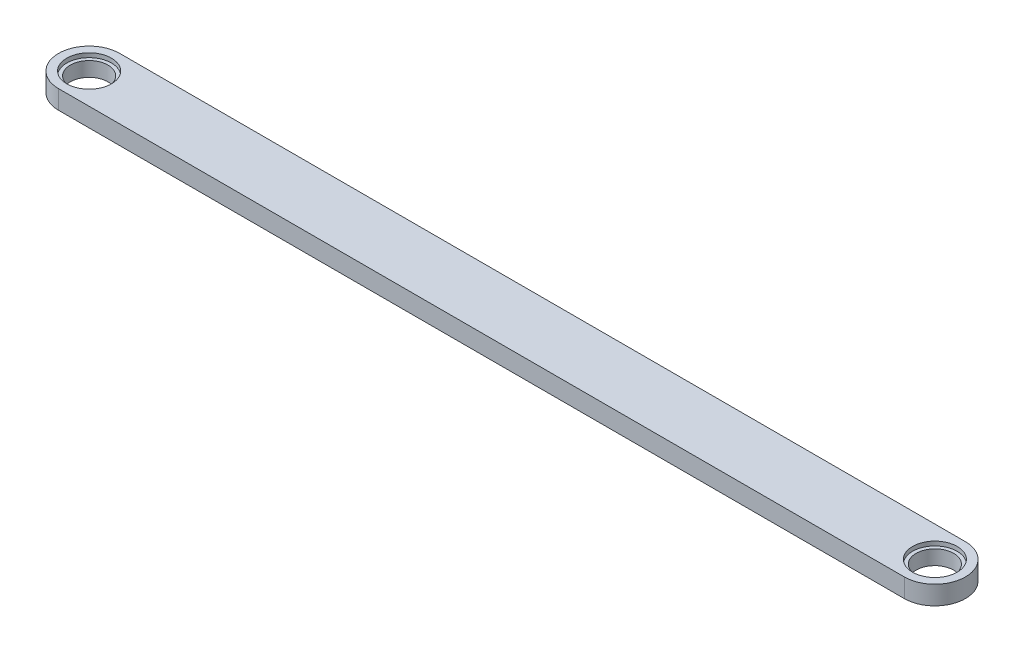
ISO-10303-21;
HEADER;
FILE_DESCRIPTION(('STEP AP214'),'2;1');
FILE_NAME('part.step','',(''),(''),'','','');
FILE_SCHEMA(('AUTOMOTIVE_DESIGN { 1 0 10303 214 1 1 1 1 }'));
ENDSEC;
DATA;
#1=APPLICATION_CONTEXT('core data for automotive mechanical design processes');
#2=APPLICATION_PROTOCOL_DEFINITION('international standard','automotive_design',2000,#1);
#3=PRODUCT_CONTEXT('',#1,'mechanical');
#4=PRODUCT('Part','Part','',(#3));
#5=PRODUCT_RELATED_PRODUCT_CATEGORY('part','',(#4));
#6=PRODUCT_DEFINITION_FORMATION('','',#4);
#7=PRODUCT_DEFINITION_CONTEXT('part definition',#1,'design');
#8=PRODUCT_DEFINITION('design','',#6,#7);
#9=PRODUCT_DEFINITION_SHAPE('','',#8);
#10=(LENGTH_UNIT() NAMED_UNIT(*) SI_UNIT(.MILLI.,.METRE.));
#11=(NAMED_UNIT(*) PLANE_ANGLE_UNIT() SI_UNIT($,.RADIAN.));
#12=(NAMED_UNIT(*) SI_UNIT($,.STERADIAN.) SOLID_ANGLE_UNIT());
#13=UNCERTAINTY_MEASURE_WITH_UNIT(LENGTH_MEASURE(1.E-05),#10,'distance_accuracy_value','');
#14=(GEOMETRIC_REPRESENTATION_CONTEXT(3) GLOBAL_UNCERTAINTY_ASSIGNED_CONTEXT((#13)) GLOBAL_UNIT_ASSIGNED_CONTEXT((#10,
#11,#12)) REPRESENTATION_CONTEXT('',''));
#15=CARTESIAN_POINT('',(0.,0.,0.));
#16=DIRECTION('',(0.,0.,1.));
#17=DIRECTION('',(1.,0.,0.));
#18=AXIS2_PLACEMENT_3D('',#15,#16,#17);
#19=CARTESIAN_POINT('',(0.,4.,0.));
#20=DIRECTION('',(0.,-1.,0.));
#21=DIRECTION('',(0.,0.,-1.));
#22=AXIS2_PLACEMENT_3D('',#19,#20,#21);
#23=CYLINDRICAL_SURFACE('',#22,6.5);
#24=CARTESIAN_POINT('',(0.,0.,0.));
#25=DIRECTION('',(0.,1.,0.));
#26=DIRECTION('',(0.,0.,1.));
#27=AXIS2_PLACEMENT_3D('',#24,#25,#26);
#28=CIRCLE('',#27,6.5);
#29=CARTESIAN_POINT('',(0.,0.,-6.5));
#30=VERTEX_POINT('',#29);
#31=CARTESIAN_POINT('',(0.,0.,6.5));
#32=VERTEX_POINT('',#31);
#33=EDGE_CURVE('E104',#30,#32,#28,.T.);
#34=ORIENTED_EDGE('',*,*,#33,.T.);
#35=DIRECTION('',(0.,-1.,0.));
#36=VECTOR('',#35,1.);
#37=CARTESIAN_POINT('',(0.,4.,6.5));
#38=LINE('',#37,#36);
#39=CARTESIAN_POINT('',(0.,4.,6.5));
#40=VERTEX_POINT('',#39);
#41=EDGE_CURVE('E11',#40,#32,#38,.T.);
#42=ORIENTED_EDGE('',*,*,#41,.F.);
#43=CARTESIAN_POINT('',(0.,4.,0.));
#44=DIRECTION('',(0.,1.,0.));
#45=DIRECTION('',(0.,0.,1.));
#46=AXIS2_PLACEMENT_3D('',#43,#44,#45);
#47=CIRCLE('',#46,6.5);
#48=CARTESIAN_POINT('',(0.,4.,-6.5));
#49=VERTEX_POINT('',#48);
#50=EDGE_CURVE('E92',#49,#40,#47,.T.);
#51=ORIENTED_EDGE('',*,*,#50,.F.);
#52=DIRECTION('',(0.,-1.,0.));
#53=VECTOR('',#52,1.);
#54=CARTESIAN_POINT('',(0.,4.,-6.5));
#55=LINE('',#54,#53);
#56=EDGE_CURVE('E100',#49,#30,#55,.T.);
#57=ORIENTED_EDGE('',*,*,#56,.T.);
#58=EDGE_LOOP('',(#34,#42,#51,#57));
#59=FACE_BOUND('',#58,.T.);
#60=ADVANCED_FACE('F41',(#59),#23,.T.);
#61=CARTESIAN_POINT('',(0.,4.,6.5));
#62=DIRECTION('',(0.,0.,-1.));
#63=DIRECTION('',(-1.,0.,0.));
#64=AXIS2_PLACEMENT_3D('',#61,#62,#63);
#65=PLANE('',#64);
#66=DIRECTION('',(1.,0.,0.));
#67=VECTOR('',#66,1.);
#68=CARTESIAN_POINT('',(0.,0.,6.5));
#69=LINE('',#68,#67);
#70=CARTESIAN_POINT('',(180.,0.,6.5));
#71=VERTEX_POINT('',#70);
#72=EDGE_CURVE('E96',#32,#71,#69,.T.);
#73=ORIENTED_EDGE('',*,*,#72,.T.);
#74=DIRECTION('',(0.,-1.,0.));
#75=VECTOR('',#74,1.);
#76=CARTESIAN_POINT('',(180.,4.,6.5));
#77=LINE('',#76,#75);
#78=CARTESIAN_POINT('',(180.,4.,6.5));
#79=VERTEX_POINT('',#78);
#80=EDGE_CURVE('E49',#79,#71,#77,.T.);
#81=ORIENTED_EDGE('',*,*,#80,.F.);
#82=DIRECTION('',(1.,0.,0.));
#83=VECTOR('',#82,1.);
#84=CARTESIAN_POINT('',(0.,4.,6.5));
#85=LINE('',#84,#83);
#86=EDGE_CURVE('E87',#40,#79,#85,.T.);
#87=ORIENTED_EDGE('',*,*,#86,.F.);
#88=ORIENTED_EDGE('',*,*,#41,.T.);
#89=EDGE_LOOP('',(#73,#81,#87,#88));
#90=FACE_BOUND('',#89,.T.);
#91=ADVANCED_FACE('F95',(#90),#65,.F.);
#92=CARTESIAN_POINT('',(180.,4.,0.));
#93=DIRECTION('',(0.,-1.,0.));
#94=DIRECTION('',(0.,0.,-1.));
#95=AXIS2_PLACEMENT_3D('',#92,#93,#94);
#96=CYLINDRICAL_SURFACE('',#95,6.5);
#97=CARTESIAN_POINT('',(180.,0.,0.));
#98=DIRECTION('',(0.,1.,0.));
#99=DIRECTION('',(0.,0.,1.));
#100=AXIS2_PLACEMENT_3D('',#97,#98,#99);
#101=CIRCLE('',#100,6.5);
#102=CARTESIAN_POINT('',(180.,0.,-6.5));
#103=VERTEX_POINT('',#102);
#104=EDGE_CURVE('E74',#71,#103,#101,.T.);
#105=ORIENTED_EDGE('',*,*,#104,.T.);
#106=DIRECTION('',(0.,-1.,0.));
#107=VECTOR('',#106,1.);
#108=CARTESIAN_POINT('',(180.,4.,-6.5));
#109=LINE('',#108,#107);
#110=CARTESIAN_POINT('',(180.,4.,-6.5));
#111=VERTEX_POINT('',#110);
#112=EDGE_CURVE('E97',#111,#103,#109,.T.);
#113=ORIENTED_EDGE('',*,*,#112,.F.);
#114=CARTESIAN_POINT('',(180.,4.,0.));
#115=DIRECTION('',(0.,1.,0.));
#116=DIRECTION('',(0.,0.,1.));
#117=AXIS2_PLACEMENT_3D('',#114,#115,#116);
#118=CIRCLE('',#117,6.5);
#119=EDGE_CURVE('E90',#79,#111,#118,.T.);
#120=ORIENTED_EDGE('',*,*,#119,.F.);
#121=ORIENTED_EDGE('',*,*,#80,.T.);
#122=EDGE_LOOP('',(#105,#113,#120,#121));
#123=FACE_BOUND('',#122,.T.);
#124=ADVANCED_FACE('F98',(#123),#96,.T.);
#125=CARTESIAN_POINT('',(0.,4.,-6.5));
#126=DIRECTION('',(0.,0.,1.));
#127=DIRECTION('',(1.,0.,0.));
#128=AXIS2_PLACEMENT_3D('',#125,#126,#127);
#129=PLANE('',#128);
#130=DIRECTION('',(-1.,0.,0.));
#131=VECTOR('',#130,1.);
#132=CARTESIAN_POINT('',(0.,0.,-6.5));
#133=LINE('',#132,#131);
#134=EDGE_CURVE('E80',#103,#30,#133,.T.);
#135=ORIENTED_EDGE('',*,*,#134,.T.);
#136=ORIENTED_EDGE('',*,*,#56,.F.);
#137=DIRECTION('',(-1.,0.,0.));
#138=VECTOR('',#137,1.);
#139=CARTESIAN_POINT('',(0.,4.,-6.5));
#140=LINE('',#139,#138);
#141=EDGE_CURVE('E57',#111,#49,#140,.T.);
#142=ORIENTED_EDGE('',*,*,#141,.F.);
#143=ORIENTED_EDGE('',*,*,#112,.T.);
#144=EDGE_LOOP('',(#135,#136,#142,#143));
#145=FACE_BOUND('',#144,.T.);
#146=ADVANCED_FACE('F112',(#145),#129,.F.);
#147=CARTESIAN_POINT('',(0.,4.,0.));
#148=DIRECTION('',(0.,1.,0.));
#149=DIRECTION('',(0.,0.,1.));
#150=AXIS2_PLACEMENT_3D('',#147,#148,#149);
#151=PLANE('',#150);
#152=CARTESIAN_POINT('',(180.,4.,0.));
#153=DIRECTION('',(0.,1.,0.));
#154=DIRECTION('',(0.,0.,1.));
#155=AXIS2_PLACEMENT_3D('',#152,#153,#154);
#156=CIRCLE('',#155,4.75);
#157=CARTESIAN_POINT('',(180.,4.,4.75));
#158=VERTEX_POINT('',#157);
#159=EDGE_CURVE('E138',#158,#158,#156,.T.);
#160=ORIENTED_EDGE('',*,*,#159,.F.);
#161=EDGE_LOOP('',(#160));
#162=FACE_BOUND('',#161,.T.);
#163=CARTESIAN_POINT('',(0.,4.,0.));
#164=DIRECTION('',(0.,1.,0.));
#165=DIRECTION('',(0.,0.,1.));
#166=AXIS2_PLACEMENT_3D('',#163,#164,#165);
#167=CIRCLE('',#166,4.75);
#168=CARTESIAN_POINT('',(0.,4.,4.75));
#169=VERTEX_POINT('',#168);
#170=EDGE_CURVE('E126',#169,#169,#167,.T.);
#171=ORIENTED_EDGE('',*,*,#170,.F.);
#172=EDGE_LOOP('',(#171));
#173=FACE_BOUND('',#172,.T.);
#174=ORIENTED_EDGE('',*,*,#50,.T.);
#175=ORIENTED_EDGE('',*,*,#86,.T.);
#176=ORIENTED_EDGE('',*,*,#119,.T.);
#177=ORIENTED_EDGE('',*,*,#141,.T.);
#178=EDGE_LOOP('',(#174,#175,#176,#177));
#179=FACE_BOUND('',#178,.T.);
#180=ADVANCED_FACE('F88',(#162,#173,#179),#151,.T.);
#181=CARTESIAN_POINT('',(0.,0.,0.));
#182=DIRECTION('',(0.,1.,0.));
#183=DIRECTION('',(0.,0.,1.));
#184=AXIS2_PLACEMENT_3D('',#181,#182,#183);
#185=PLANE('',#184);
#186=CARTESIAN_POINT('',(180.,0.,0.));
#187=DIRECTION('',(0.,1.,0.));
#188=DIRECTION('',(0.,0.,1.));
#189=AXIS2_PLACEMENT_3D('',#186,#187,#188);
#190=CIRCLE('',#189,4.);
#191=CARTESIAN_POINT('',(180.,0.,4.));
#192=VERTEX_POINT('',#191);
#193=EDGE_CURVE('E129',#192,#192,#190,.T.);
#194=ORIENTED_EDGE('',*,*,#193,.T.);
#195=EDGE_LOOP('',(#194));
#196=FACE_BOUND('',#195,.T.);
#197=CARTESIAN_POINT('',(0.,0.,0.));
#198=DIRECTION('',(0.,1.,0.));
#199=DIRECTION('',(0.,0.,1.));
#200=AXIS2_PLACEMENT_3D('',#197,#198,#199);
#201=CIRCLE('',#200,4.);
#202=CARTESIAN_POINT('',(0.,0.,4.));
#203=VERTEX_POINT('',#202);
#204=EDGE_CURVE('E107',#203,#203,#201,.T.);
#205=ORIENTED_EDGE('',*,*,#204,.T.);
#206=EDGE_LOOP('',(#205));
#207=FACE_BOUND('',#206,.T.);
#208=ORIENTED_EDGE('',*,*,#33,.F.);
#209=ORIENTED_EDGE('',*,*,#134,.F.);
#210=ORIENTED_EDGE('',*,*,#104,.F.);
#211=ORIENTED_EDGE('',*,*,#72,.F.);
#212=EDGE_LOOP('',(#208,#209,#210,#211));
#213=FACE_BOUND('',#212,.T.);
#214=ADVANCED_FACE('F115',(#196,#207,#213),#185,.F.);
#215=CARTESIAN_POINT('',(0.,4.,0.));
#216=DIRECTION('',(0.,1.,0.));
#217=DIRECTION('',(0.,0.,1.));
#218=AXIS2_PLACEMENT_3D('',#215,#216,#217);
#219=CYLINDRICAL_SURFACE('',#218,4.);
#220=ORIENTED_EDGE('',*,*,#204,.F.);
#221=EDGE_LOOP('',(#220));
#222=FACE_BOUND('',#221,.T.);
#223=CARTESIAN_POINT('',(0.,3.1,0.));
#224=DIRECTION('',(0.,1.,0.));
#225=DIRECTION('',(0.,0.,1.));
#226=AXIS2_PLACEMENT_3D('',#223,#224,#225);
#227=CIRCLE('',#226,4.);
#228=CARTESIAN_POINT('',(0.,3.1,4.));
#229=VERTEX_POINT('',#228);
#230=EDGE_CURVE('E120',#229,#229,#227,.T.);
#231=ORIENTED_EDGE('',*,*,#230,.T.);
#232=EDGE_LOOP('',(#231));
#233=FACE_BOUND('',#232,.T.);
#234=ADVANCED_FACE('F162',(#222,#233),#219,.F.);
#235=CARTESIAN_POINT('',(4.,3.1,0.));
#236=DIRECTION('',(0.,-1.,0.));
#237=DIRECTION('',(0.,0.,-1.));
#238=AXIS2_PLACEMENT_3D('',#235,#236,#237);
#239=PLANE('',#238);
#240=ORIENTED_EDGE('',*,*,#230,.F.);
#241=EDGE_LOOP('',(#240));
#242=FACE_BOUND('',#241,.T.);
#243=CARTESIAN_POINT('',(0.,3.1,0.));
#244=DIRECTION('',(0.,1.,0.));
#245=DIRECTION('',(0.,0.,1.));
#246=AXIS2_PLACEMENT_3D('',#243,#244,#245);
#247=CIRCLE('',#246,4.75);
#248=CARTESIAN_POINT('',(0.,3.1,4.75));
#249=VERTEX_POINT('',#248);
#250=EDGE_CURVE('E123',#249,#249,#247,.T.);
#251=ORIENTED_EDGE('',*,*,#250,.T.);
#252=EDGE_LOOP('',(#251));
#253=FACE_BOUND('',#252,.T.);
#254=ADVANCED_FACE('F152',(#242,#253),#239,.F.);
#255=CARTESIAN_POINT('',(0.,4.,0.));
#256=DIRECTION('',(0.,1.,0.));
#257=DIRECTION('',(0.,0.,1.));
#258=AXIS2_PLACEMENT_3D('',#255,#256,#257);
#259=CYLINDRICAL_SURFACE('',#258,4.75);
#260=ORIENTED_EDGE('',*,*,#250,.F.);
#261=EDGE_LOOP('',(#260));
#262=FACE_BOUND('',#261,.T.);
#263=ORIENTED_EDGE('',*,*,#170,.T.);
#264=EDGE_LOOP('',(#263));
#265=FACE_BOUND('',#264,.T.);
#266=ADVANCED_FACE('F149',(#262,#265),#259,.F.);
#267=CARTESIAN_POINT('',(180.,4.,0.));
#268=DIRECTION('',(0.,1.,0.));
#269=DIRECTION('',(0.,0.,1.));
#270=AXIS2_PLACEMENT_3D('',#267,#268,#269);
#271=CYLINDRICAL_SURFACE('',#270,4.);
#272=ORIENTED_EDGE('',*,*,#193,.F.);
#273=EDGE_LOOP('',(#272));
#274=FACE_BOUND('',#273,.T.);
#275=CARTESIAN_POINT('',(180.,3.1,0.));
#276=DIRECTION('',(0.,1.,0.));
#277=DIRECTION('',(0.,0.,1.));
#278=AXIS2_PLACEMENT_3D('',#275,#276,#277);
#279=CIRCLE('',#278,4.);
#280=CARTESIAN_POINT('',(180.,3.1,4.));
#281=VERTEX_POINT('',#280);
#282=EDGE_CURVE('E132',#281,#281,#279,.T.);
#283=ORIENTED_EDGE('',*,*,#282,.T.);
#284=EDGE_LOOP('',(#283));
#285=FACE_BOUND('',#284,.T.);
#286=ADVANCED_FACE('F151',(#274,#285),#271,.F.);
#287=CARTESIAN_POINT('',(184.,3.1,0.));
#288=DIRECTION('',(0.,-1.,0.));
#289=DIRECTION('',(0.,0.,-1.));
#290=AXIS2_PLACEMENT_3D('',#287,#288,#289);
#291=PLANE('',#290);
#292=ORIENTED_EDGE('',*,*,#282,.F.);
#293=EDGE_LOOP('',(#292));
#294=FACE_BOUND('',#293,.T.);
#295=CARTESIAN_POINT('',(180.,3.1,0.));
#296=DIRECTION('',(0.,1.,0.));
#297=DIRECTION('',(0.,0.,1.));
#298=AXIS2_PLACEMENT_3D('',#295,#296,#297);
#299=CIRCLE('',#298,4.75);
#300=CARTESIAN_POINT('',(180.,3.1,4.75));
#301=VERTEX_POINT('',#300);
#302=EDGE_CURVE('E135',#301,#301,#299,.T.);
#303=ORIENTED_EDGE('',*,*,#302,.T.);
#304=EDGE_LOOP('',(#303));
#305=FACE_BOUND('',#304,.T.);
#306=ADVANCED_FACE('F159',(#294,#305),#291,.F.);
#307=CARTESIAN_POINT('',(180.,4.,0.));
#308=DIRECTION('',(0.,1.,0.));
#309=DIRECTION('',(0.,0.,1.));
#310=AXIS2_PLACEMENT_3D('',#307,#308,#309);
#311=CYLINDRICAL_SURFACE('',#310,4.75);
#312=ORIENTED_EDGE('',*,*,#302,.F.);
#313=EDGE_LOOP('',(#312));
#314=FACE_BOUND('',#313,.T.);
#315=ORIENTED_EDGE('',*,*,#159,.T.);
#316=EDGE_LOOP('',(#315));
#317=FACE_BOUND('',#316,.T.);
#318=ADVANCED_FACE('F142',(#314,#317),#311,.F.);
#319=CLOSED_SHELL('',(#60,#91,#124,#146,#180,#214,#234,#254,#266,#286,#306,#318));
#320=MANIFOLD_SOLID_BREP('B2',#319);
#321=ADVANCED_BREP_SHAPE_REPRESENTATION('',(#18,#320),#14);
#322=SHAPE_DEFINITION_REPRESENTATION(#9,#321);
ENDSEC;
END-ISO-10303-21;
